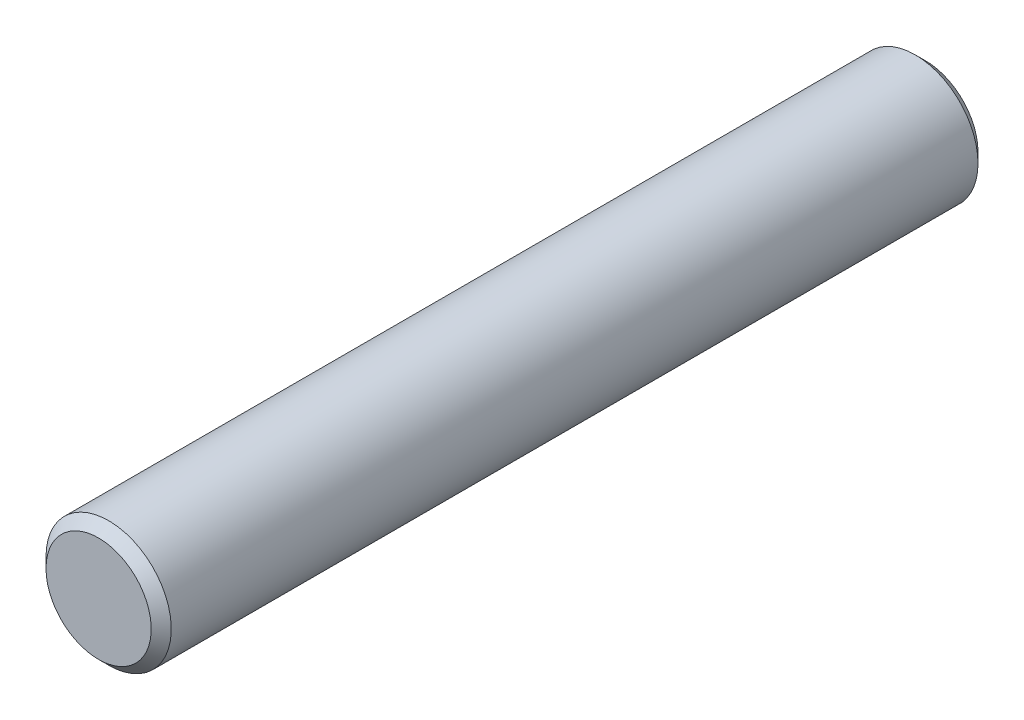
ISO-10303-21;
HEADER;
FILE_DESCRIPTION(('STEP AP214'),'2;1');
FILE_NAME('part.step','',(''),(''),'','','');
FILE_SCHEMA(('AUTOMOTIVE_DESIGN { 1 0 10303 214 1 1 1 1 }'));
ENDSEC;
DATA;
#1=APPLICATION_CONTEXT('core data for automotive mechanical design processes');
#2=APPLICATION_PROTOCOL_DEFINITION('international standard','automotive_design',2000,#1);
#3=PRODUCT_CONTEXT('',#1,'mechanical');
#4=PRODUCT('Part','Part','',(#3));
#5=PRODUCT_RELATED_PRODUCT_CATEGORY('part','',(#4));
#6=PRODUCT_DEFINITION_FORMATION('','',#4);
#7=PRODUCT_DEFINITION_CONTEXT('part definition',#1,'design');
#8=PRODUCT_DEFINITION('design','',#6,#7);
#9=PRODUCT_DEFINITION_SHAPE('','',#8);
#10=(LENGTH_UNIT() NAMED_UNIT(*) SI_UNIT(.MILLI.,.METRE.));
#11=(NAMED_UNIT(*) PLANE_ANGLE_UNIT() SI_UNIT($,.RADIAN.));
#12=(NAMED_UNIT(*) SI_UNIT($,.STERADIAN.) SOLID_ANGLE_UNIT());
#13=UNCERTAINTY_MEASURE_WITH_UNIT(LENGTH_MEASURE(1.E-05),#10,'distance_accuracy_value','');
#14=(GEOMETRIC_REPRESENTATION_CONTEXT(3) GLOBAL_UNCERTAINTY_ASSIGNED_CONTEXT((#13)) GLOBAL_UNIT_ASSIGNED_CONTEXT((#10,
#11,#12)) REPRESENTATION_CONTEXT('',''));
#15=CARTESIAN_POINT('',(0.,0.,0.));
#16=DIRECTION('',(0.,0.,1.));
#17=DIRECTION('',(1.,0.,0.));
#18=AXIS2_PLACEMENT_3D('',#15,#16,#17);
#19=CARTESIAN_POINT('',(0.,0.,33.));
#20=DIRECTION('',(0.,0.,1.));
#21=DIRECTION('',(1.,0.,0.));
#22=AXIS2_PLACEMENT_3D('',#19,#20,#21);
#23=PLANE('',#22);
#24=CARTESIAN_POINT('',(0.,0.,32.9999999999586));
#25=DIRECTION('',(0.,0.,-1.));
#26=DIRECTION('',(-1.,0.,0.));
#27=AXIS2_PLACEMENT_3D('',#24,#25,#26);
#28=CIRCLE('',#27,2.10000000009813);
#29=CARTESIAN_POINT('',(-2.10000000009813,0.,32.9999999999586));
#30=VERTEX_POINT('',#29);
#31=EDGE_CURVE('E18',#30,#30,#28,.T.);
#32=ORIENTED_EDGE('',*,*,#31,.F.);
#33=EDGE_LOOP('',(#32));
#34=FACE_BOUND('',#33,.T.);
#35=ADVANCED_FACE('F15',(#34),#23,.T.);
#36=CARTESIAN_POINT('',(0.,0.,0.));
#37=DIRECTION('',(0.,0.,1.));
#38=DIRECTION('',(1.,0.,0.));
#39=AXIS2_PLACEMENT_3D('',#36,#37,#38);
#40=PLANE('',#39);
#41=CARTESIAN_POINT('',(0.,0.,5.6843418860808E-11));
#42=DIRECTION('',(0.,0.,1.));
#43=DIRECTION('',(1.,0.,0.));
#44=AXIS2_PLACEMENT_3D('',#41,#42,#43);
#45=CIRCLE('',#44,2.09999999998445);
#46=CARTESIAN_POINT('',(2.09999999998445,0.,5.6843418860808E-11));
#47=VERTEX_POINT('',#46);
#48=EDGE_CURVE('E27',#47,#47,#45,.T.);
#49=ORIENTED_EDGE('',*,*,#48,.F.);
#50=EDGE_LOOP('',(#49));
#51=FACE_BOUND('',#50,.T.);
#52=ADVANCED_FACE('F38',(#51),#40,.F.);
#53=CARTESIAN_POINT('',(0.,0.,32.600000000059));
#54=DIRECTION('',(0.,0.,-1.));
#55=DIRECTION('',(-1.,0.,0.));
#56=AXIS2_PLACEMENT_3D('',#53,#54,#55);
#57=CONICAL_SURFACE('',#56,2.49999999999773,0.785398163397448);
#58=CARTESIAN_POINT('',(0.,0.,32.6));
#59=DIRECTION('',(0.,0.,-1.));
#60=DIRECTION('',(-1.,0.,0.));
#61=AXIS2_PLACEMENT_3D('',#58,#59,#60);
#62=CIRCLE('',#61,2.5);
#63=CARTESIAN_POINT('',(-2.5,0.,32.6));
#64=VERTEX_POINT('',#63);
#65=EDGE_CURVE('E22',#64,#64,#62,.T.);
#66=ORIENTED_EDGE('',*,*,#65,.F.);
#67=EDGE_LOOP('',(#66));
#68=FACE_BOUND('',#67,.T.);
#69=ORIENTED_EDGE('',*,*,#31,.T.);
#70=EDGE_LOOP('',(#69));
#71=FACE_BOUND('',#70,.T.);
#72=ADVANCED_FACE('F35',(#68,#71),#57,.T.);
#73=CARTESIAN_POINT('',(0.,0.,0.399999999956435));
#74=DIRECTION('',(0.,0.,1.));
#75=DIRECTION('',(1.,0.,0.));
#76=AXIS2_PLACEMENT_3D('',#73,#74,#75);
#77=CONICAL_SURFACE('',#76,2.49999999988404,0.785398163397448);
#78=CARTESIAN_POINT('',(0.,0.,0.399999999999998));
#79=DIRECTION('',(0.,0.,-1.));
#80=DIRECTION('',(-1.,0.,0.));
#81=AXIS2_PLACEMENT_3D('',#78,#79,#80);
#82=CIRCLE('',#81,2.5);
#83=CARTESIAN_POINT('',(-2.5,0.,0.399999999999998));
#84=VERTEX_POINT('',#83);
#85=EDGE_CURVE('E10',#84,#84,#82,.F.);
#86=ORIENTED_EDGE('',*,*,#85,.F.);
#87=EDGE_LOOP('',(#86));
#88=FACE_BOUND('',#87,.T.);
#89=ORIENTED_EDGE('',*,*,#48,.T.);
#90=EDGE_LOOP('',(#89));
#91=FACE_BOUND('',#90,.T.);
#92=ADVANCED_FACE('F46',(#88,#91),#77,.T.);
#93=CARTESIAN_POINT('',(0.,0.,33.));
#94=DIRECTION('',(0.,0.,-1.));
#95=DIRECTION('',(-1.,0.,0.));
#96=AXIS2_PLACEMENT_3D('',#93,#94,#95);
#97=CYLINDRICAL_SURFACE('',#96,2.5);
#98=ORIENTED_EDGE('',*,*,#85,.T.);
#99=EDGE_LOOP('',(#98));
#100=FACE_BOUND('',#99,.T.);
#101=ORIENTED_EDGE('',*,*,#65,.T.);
#102=EDGE_LOOP('',(#101));
#103=FACE_BOUND('',#102,.T.);
#104=ADVANCED_FACE('F44',(#100,#103),#97,.T.);
#105=CLOSED_SHELL('',(#35,#52,#72,#92,#104));
#106=MANIFOLD_SOLID_BREP('B1',#105);
#107=ADVANCED_BREP_SHAPE_REPRESENTATION('',(#18,#106),#14);
#108=SHAPE_DEFINITION_REPRESENTATION(#9,#107);
ENDSEC;
END-ISO-10303-21;
